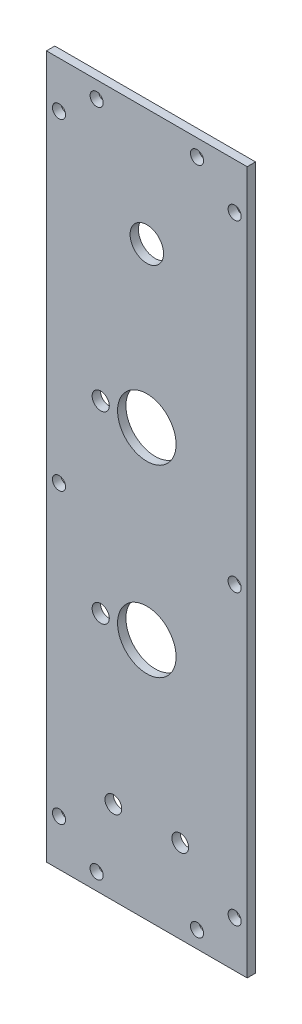
ISO-10303-21;
HEADER;
FILE_DESCRIPTION(('STEP AP214'),'2;1');
FILE_NAME('part.step','',(''),(''),'','','');
FILE_SCHEMA(('AUTOMOTIVE_DESIGN { 1 0 10303 214 1 1 1 1 }'));
ENDSEC;
DATA;
#1=APPLICATION_CONTEXT('core data for automotive mechanical design processes');
#2=APPLICATION_PROTOCOL_DEFINITION('international standard','automotive_design',2000,#1);
#3=PRODUCT_CONTEXT('',#1,'mechanical');
#4=PRODUCT('Part','Part','',(#3));
#5=PRODUCT_RELATED_PRODUCT_CATEGORY('part','',(#4));
#6=PRODUCT_DEFINITION_FORMATION('','',#4);
#7=PRODUCT_DEFINITION_CONTEXT('part definition',#1,'design');
#8=PRODUCT_DEFINITION('design','',#6,#7);
#9=PRODUCT_DEFINITION_SHAPE('','',#8);
#10=(LENGTH_UNIT() NAMED_UNIT(*) SI_UNIT(.MILLI.,.METRE.));
#11=(NAMED_UNIT(*) PLANE_ANGLE_UNIT() SI_UNIT($,.RADIAN.));
#12=(NAMED_UNIT(*) SI_UNIT($,.STERADIAN.) SOLID_ANGLE_UNIT());
#13=UNCERTAINTY_MEASURE_WITH_UNIT(LENGTH_MEASURE(1.E-05),#10,'distance_accuracy_value','');
#14=(GEOMETRIC_REPRESENTATION_CONTEXT(3) GLOBAL_UNCERTAINTY_ASSIGNED_CONTEXT((#13)) GLOBAL_UNIT_ASSIGNED_CONTEXT((#10,
#11,#12)) REPRESENTATION_CONTEXT('',''));
#15=CARTESIAN_POINT('',(0.,0.,0.));
#16=DIRECTION('',(0.,0.,1.));
#17=DIRECTION('',(1.,0.,0.));
#18=AXIS2_PLACEMENT_3D('',#15,#16,#17);
#19=CARTESIAN_POINT('',(0.,0.,3.175));
#20=DIRECTION('',(0.,0.,1.));
#21=DIRECTION('',(1.,0.,0.));
#22=AXIS2_PLACEMENT_3D('',#19,#20,#21);
#23=PLANE('',#22);
#24=CARTESIAN_POINT('',(50.8,-234.95,3.175));
#25=DIRECTION('',(0.,0.,1.));
#26=DIRECTION('',(1.,0.,0.));
#27=AXIS2_PLACEMENT_3D('',#24,#25,#26);
#28=CIRCLE('',#27,3.175);
#29=CARTESIAN_POINT('',(53.975,-234.95,3.175));
#30=VERTEX_POINT('',#29);
#31=EDGE_CURVE('E233',#30,#30,#28,.T.);
#32=ORIENTED_EDGE('',*,*,#31,.F.);
#33=EDGE_LOOP('',(#32));
#34=FACE_BOUND('',#33,.T.);
#35=CARTESIAN_POINT('',(20.599908,-174.625,3.175));
#36=DIRECTION('',(0.,0.,1.));
#37=DIRECTION('',(1.,0.,0.));
#38=AXIS2_PLACEMENT_3D('',#35,#36,#37);
#39=CIRCLE('',#38,3.2512);
#40=CARTESIAN_POINT('',(23.851108,-174.625,3.175));
#41=VERTEX_POINT('',#40);
#42=EDGE_CURVE('E242',#41,#41,#39,.T.);
#43=ORIENTED_EDGE('',*,*,#42,.F.);
#44=EDGE_LOOP('',(#43));
#45=FACE_BOUND('',#44,.T.);
#46=CARTESIAN_POINT('',(38.1,-174.625,3.175));
#47=DIRECTION('',(0.,0.,1.));
#48=DIRECTION('',(1.,0.,0.));
#49=AXIS2_PLACEMENT_3D('',#46,#47,#48);
#50=CIRCLE('',#49,11.1125);
#51=CARTESIAN_POINT('',(49.2125,-174.625,3.175));
#52=VERTEX_POINT('',#51);
#53=EDGE_CURVE('E217',#52,#52,#50,.T.);
#54=ORIENTED_EDGE('',*,*,#53,.F.);
#55=EDGE_LOOP('',(#54));
#56=FACE_BOUND('',#55,.T.);
#57=CARTESIAN_POINT('',(20.599908,-104.775,3.175));
#58=DIRECTION('',(0.,0.,1.));
#59=DIRECTION('',(1.,0.,0.));
#60=AXIS2_PLACEMENT_3D('',#57,#58,#59);
#61=CIRCLE('',#60,3.2512);
#62=CARTESIAN_POINT('',(23.851108,-104.775,3.175));
#63=VERTEX_POINT('',#62);
#64=EDGE_CURVE('E226',#63,#63,#61,.T.);
#65=ORIENTED_EDGE('',*,*,#64,.F.);
#66=EDGE_LOOP('',(#65));
#67=FACE_BOUND('',#66,.T.);
#68=CARTESIAN_POINT('',(25.4,-234.95,3.175));
#69=DIRECTION('',(0.,0.,1.));
#70=DIRECTION('',(1.,0.,0.));
#71=AXIS2_PLACEMENT_3D('',#68,#69,#70);
#72=CIRCLE('',#71,3.175);
#73=CARTESIAN_POINT('',(28.575,-234.95,3.175));
#74=VERTEX_POINT('',#73);
#75=EDGE_CURVE('E257',#74,#74,#72,.T.);
#76=ORIENTED_EDGE('',*,*,#75,.F.);
#77=EDGE_LOOP('',(#76));
#78=FACE_BOUND('',#77,.T.);
#79=CARTESIAN_POINT('',(38.1,-44.45,3.175));
#80=DIRECTION('',(0.,0.,1.));
#81=DIRECTION('',(1.,0.,0.));
#82=AXIS2_PLACEMENT_3D('',#79,#80,#81);
#83=CIRCLE('',#82,6.35);
#84=CARTESIAN_POINT('',(44.45,-44.45,3.175));
#85=VERTEX_POINT('',#84);
#86=EDGE_CURVE('E249',#85,#85,#83,.T.);
#87=ORIENTED_EDGE('',*,*,#86,.F.);
#88=EDGE_LOOP('',(#87));
#89=FACE_BOUND('',#88,.T.);
#90=CARTESIAN_POINT('',(38.1,-104.775,3.175));
#91=DIRECTION('',(0.,0.,1.));
#92=DIRECTION('',(1.,0.,0.));
#93=AXIS2_PLACEMENT_3D('',#90,#91,#92);
#94=CIRCLE('',#93,11.1125);
#95=CARTESIAN_POINT('',(49.2125,-104.775,3.175));
#96=VERTEX_POINT('',#95);
#97=EDGE_CURVE('E209',#96,#96,#94,.T.);
#98=ORIENTED_EDGE('',*,*,#97,.F.);
#99=EDGE_LOOP('',(#98));
#100=FACE_BOUND('',#99,.T.);
#101=CARTESIAN_POINT('',(19.05,-260.35,3.175));
#102=DIRECTION('',(0.,0.,1.));
#103=DIRECTION('',(1.,0.,0.));
#104=AXIS2_PLACEMENT_3D('',#101,#102,#103);
#105=CIRCLE('',#104,2.4892);
#106=CARTESIAN_POINT('',(21.5392,-260.35,3.175));
#107=VERTEX_POINT('',#106);
#108=EDGE_CURVE('E189',#107,#107,#105,.T.);
#109=ORIENTED_EDGE('',*,*,#108,.F.);
#110=EDGE_LOOP('',(#109));
#111=FACE_BOUND('',#110,.T.);
#112=CARTESIAN_POINT('',(71.4375,-249.2375,3.175));
#113=DIRECTION('',(0.,0.,1.));
#114=DIRECTION('',(1.,0.,0.));
#115=AXIS2_PLACEMENT_3D('',#112,#113,#114);
#116=CIRCLE('',#115,2.48920000000001);
#117=CARTESIAN_POINT('',(73.9267,-249.2375,3.175));
#118=VERTEX_POINT('',#117);
#119=EDGE_CURVE('E173',#118,#118,#116,.T.);
#120=ORIENTED_EDGE('',*,*,#119,.F.);
#121=EDGE_LOOP('',(#120));
#122=FACE_BOUND('',#121,.T.);
#123=CARTESIAN_POINT('',(71.4375,-139.7,3.175));
#124=DIRECTION('',(0.,0.,1.));
#125=DIRECTION('',(1.,0.,0.));
#126=AXIS2_PLACEMENT_3D('',#123,#124,#125);
#127=CIRCLE('',#126,2.48920000000001);
#128=CARTESIAN_POINT('',(73.9267,-139.7,3.175));
#129=VERTEX_POINT('',#128);
#130=EDGE_CURVE('E157',#129,#129,#127,.T.);
#131=ORIENTED_EDGE('',*,*,#130,.F.);
#132=EDGE_LOOP('',(#131));
#133=FACE_BOUND('',#132,.T.);
#134=CARTESIAN_POINT('',(71.4375,-17.4625,3.175));
#135=DIRECTION('',(0.,0.,1.));
#136=DIRECTION('',(1.,0.,0.));
#137=AXIS2_PLACEMENT_3D('',#134,#135,#136);
#138=CIRCLE('',#137,2.4892);
#139=CARTESIAN_POINT('',(73.9267,-17.4625,3.175));
#140=VERTEX_POINT('',#139);
#141=EDGE_CURVE('E141',#140,#140,#138,.T.);
#142=ORIENTED_EDGE('',*,*,#141,.F.);
#143=EDGE_LOOP('',(#142));
#144=FACE_BOUND('',#143,.T.);
#145=CARTESIAN_POINT('',(19.05,-6.35,3.175));
#146=DIRECTION('',(0.,0.,1.));
#147=DIRECTION('',(1.,0.,0.));
#148=AXIS2_PLACEMENT_3D('',#145,#146,#147);
#149=CIRCLE('',#148,2.4892);
#150=CARTESIAN_POINT('',(21.5392,-6.35,3.175));
#151=VERTEX_POINT('',#150);
#152=EDGE_CURVE('E111',#151,#151,#149,.T.);
#153=ORIENTED_EDGE('',*,*,#152,.F.);
#154=EDGE_LOOP('',(#153));
#155=FACE_BOUND('',#154,.T.);
#156=DIRECTION('',(0.,-1.,0.));
#157=VECTOR('',#156,1.);
#158=CARTESIAN_POINT('',(0.,0.,3.175));
#159=LINE('',#158,#157);
#160=CARTESIAN_POINT('',(0.,0.,3.175));
#161=VERTEX_POINT('',#160);
#162=CARTESIAN_POINT('',(0.,-266.7,3.175));
#163=VERTEX_POINT('',#162);
#164=EDGE_CURVE('E91',#161,#163,#159,.T.);
#165=ORIENTED_EDGE('',*,*,#164,.T.);
#166=DIRECTION('',(1.,0.,0.));
#167=VECTOR('',#166,1.);
#168=CARTESIAN_POINT('',(0.,-266.7,3.175));
#169=LINE('',#168,#167);
#170=CARTESIAN_POINT('',(76.2,-266.7,3.175));
#171=VERTEX_POINT('',#170);
#172=EDGE_CURVE('E86',#163,#171,#169,.T.);
#173=ORIENTED_EDGE('',*,*,#172,.T.);
#174=DIRECTION('',(0.,1.,0.));
#175=VECTOR('',#174,1.);
#176=CARTESIAN_POINT('',(76.2,0.,3.175));
#177=LINE('',#176,#175);
#178=CARTESIAN_POINT('',(76.2,0.,3.175));
#179=VERTEX_POINT('',#178);
#180=EDGE_CURVE('E89',#171,#179,#177,.T.);
#181=ORIENTED_EDGE('',*,*,#180,.T.);
#182=DIRECTION('',(-1.,0.,0.));
#183=VECTOR('',#182,1.);
#184=CARTESIAN_POINT('',(0.,0.,3.175));
#185=LINE('',#184,#183);
#186=EDGE_CURVE('E56',#179,#161,#185,.T.);
#187=ORIENTED_EDGE('',*,*,#186,.T.);
#188=EDGE_LOOP('',(#165,#173,#181,#187));
#189=FACE_BOUND('',#188,.T.);
#190=CARTESIAN_POINT('',(57.15,-6.35,3.175));
#191=DIRECTION('',(0.,0.,1.));
#192=DIRECTION('',(1.,0.,0.));
#193=AXIS2_PLACEMENT_3D('',#190,#191,#192);
#194=CIRCLE('',#193,2.4892);
#195=CARTESIAN_POINT('',(59.6392,-6.35,3.175));
#196=VERTEX_POINT('',#195);
#197=EDGE_CURVE('E133',#196,#196,#194,.T.);
#198=ORIENTED_EDGE('',*,*,#197,.F.);
#199=EDGE_LOOP('',(#198));
#200=FACE_BOUND('',#199,.T.);
#201=CARTESIAN_POINT('',(4.7625,-17.4625,3.175));
#202=DIRECTION('',(0.,0.,1.));
#203=DIRECTION('',(1.,0.,0.));
#204=AXIS2_PLACEMENT_3D('',#201,#202,#203);
#205=CIRCLE('',#204,2.4892);
#206=CARTESIAN_POINT('',(7.2517,-17.4625,3.175));
#207=VERTEX_POINT('',#206);
#208=EDGE_CURVE('E149',#207,#207,#205,.T.);
#209=ORIENTED_EDGE('',*,*,#208,.F.);
#210=EDGE_LOOP('',(#209));
#211=FACE_BOUND('',#210,.T.);
#212=CARTESIAN_POINT('',(4.76250000000002,-139.7,3.175));
#213=DIRECTION('',(0.,0.,1.));
#214=DIRECTION('',(1.,0.,0.));
#215=AXIS2_PLACEMENT_3D('',#212,#213,#214);
#216=CIRCLE('',#215,2.4892);
#217=CARTESIAN_POINT('',(7.25170000000002,-139.7,3.175));
#218=VERTEX_POINT('',#217);
#219=EDGE_CURVE('E165',#218,#218,#216,.T.);
#220=ORIENTED_EDGE('',*,*,#219,.F.);
#221=EDGE_LOOP('',(#220));
#222=FACE_BOUND('',#221,.T.);
#223=CARTESIAN_POINT('',(4.76250000000003,-249.2375,3.175));
#224=DIRECTION('',(0.,0.,1.));
#225=DIRECTION('',(1.,0.,0.));
#226=AXIS2_PLACEMENT_3D('',#223,#224,#225);
#227=CIRCLE('',#226,2.4892);
#228=CARTESIAN_POINT('',(7.25170000000003,-249.2375,3.175));
#229=VERTEX_POINT('',#228);
#230=EDGE_CURVE('E181',#229,#229,#227,.T.);
#231=ORIENTED_EDGE('',*,*,#230,.F.);
#232=EDGE_LOOP('',(#231));
#233=FACE_BOUND('',#232,.T.);
#234=CARTESIAN_POINT('',(57.15,-260.35,3.175));
#235=DIRECTION('',(0.,0.,1.));
#236=DIRECTION('',(1.,0.,0.));
#237=AXIS2_PLACEMENT_3D('',#234,#235,#236);
#238=CIRCLE('',#237,2.4892);
#239=CARTESIAN_POINT('',(59.6392,-260.35,3.175));
#240=VERTEX_POINT('',#239);
#241=EDGE_CURVE('E197',#240,#240,#238,.T.);
#242=ORIENTED_EDGE('',*,*,#241,.F.);
#243=EDGE_LOOP('',(#242));
#244=FACE_BOUND('',#243,.T.);
#245=ADVANCED_FACE('F38',(#34,#45,#56,#67,#78,#89,#100,#111,#122,#133,#144,#155,#189,#200,#211,
#222,#233,#244),#23,.T.);
#246=CARTESIAN_POINT('',(0.,0.,0.));
#247=DIRECTION('',(0.,0.,1.));
#248=DIRECTION('',(1.,0.,0.));
#249=AXIS2_PLACEMENT_3D('',#246,#247,#248);
#250=PLANE('',#249);
#251=CARTESIAN_POINT('',(50.8,-234.95,0.));
#252=DIRECTION('',(0.,0.,1.));
#253=DIRECTION('',(1.,0.,0.));
#254=AXIS2_PLACEMENT_3D('',#251,#252,#253);
#255=CIRCLE('',#254,3.175);
#256=CARTESIAN_POINT('',(53.975,-234.95,0.));
#257=VERTEX_POINT('',#256);
#258=EDGE_CURVE('E237',#257,#257,#255,.T.);
#259=ORIENTED_EDGE('',*,*,#258,.T.);
#260=EDGE_LOOP('',(#259));
#261=FACE_BOUND('',#260,.T.);
#262=CARTESIAN_POINT('',(20.599908,-174.625,0.));
#263=DIRECTION('',(0.,0.,1.));
#264=DIRECTION('',(1.,0.,0.));
#265=AXIS2_PLACEMENT_3D('',#262,#263,#264);
#266=CIRCLE('',#265,3.2512);
#267=CARTESIAN_POINT('',(23.851108,-174.625,0.));
#268=VERTEX_POINT('',#267);
#269=EDGE_CURVE('E222',#268,#268,#266,.T.);
#270=ORIENTED_EDGE('',*,*,#269,.T.);
#271=EDGE_LOOP('',(#270));
#272=FACE_BOUND('',#271,.T.);
#273=CARTESIAN_POINT('',(38.1,-174.625,0.));
#274=DIRECTION('',(0.,0.,1.));
#275=DIRECTION('',(1.,0.,0.));
#276=AXIS2_PLACEMENT_3D('',#273,#274,#275);
#277=CIRCLE('',#276,11.1125);
#278=CARTESIAN_POINT('',(49.2125,-174.625,0.));
#279=VERTEX_POINT('',#278);
#280=EDGE_CURVE('E221',#279,#279,#277,.T.);
#281=ORIENTED_EDGE('',*,*,#280,.T.);
#282=EDGE_LOOP('',(#281));
#283=FACE_BOUND('',#282,.T.);
#284=CARTESIAN_POINT('',(20.599908,-104.775,0.));
#285=DIRECTION('',(0.,0.,1.));
#286=DIRECTION('',(1.,0.,0.));
#287=AXIS2_PLACEMENT_3D('',#284,#285,#286);
#288=CIRCLE('',#287,3.2512);
#289=CARTESIAN_POINT('',(23.851108,-104.775,0.));
#290=VERTEX_POINT('',#289);
#291=EDGE_CURVE('E213',#290,#290,#288,.T.);
#292=ORIENTED_EDGE('',*,*,#291,.T.);
#293=EDGE_LOOP('',(#292));
#294=FACE_BOUND('',#293,.T.);
#295=CARTESIAN_POINT('',(25.4,-234.95,0.));
#296=DIRECTION('',(0.,0.,1.));
#297=DIRECTION('',(1.,0.,0.));
#298=AXIS2_PLACEMENT_3D('',#295,#296,#297);
#299=CIRCLE('',#298,3.175);
#300=CARTESIAN_POINT('',(28.575,-234.95,0.));
#301=VERTEX_POINT('',#300);
#302=EDGE_CURVE('E238',#301,#301,#299,.T.);
#303=ORIENTED_EDGE('',*,*,#302,.T.);
#304=EDGE_LOOP('',(#303));
#305=FACE_BOUND('',#304,.T.);
#306=CARTESIAN_POINT('',(38.1,-44.45,0.));
#307=DIRECTION('',(0.,0.,1.));
#308=DIRECTION('',(1.,0.,0.));
#309=AXIS2_PLACEMENT_3D('',#306,#307,#308);
#310=CIRCLE('',#309,6.35);
#311=CARTESIAN_POINT('',(44.45,-44.45,0.));
#312=VERTEX_POINT('',#311);
#313=EDGE_CURVE('E253',#312,#312,#310,.T.);
#314=ORIENTED_EDGE('',*,*,#313,.T.);
#315=EDGE_LOOP('',(#314));
#316=FACE_BOUND('',#315,.T.);
#317=CARTESIAN_POINT('',(38.1,-104.775,0.));
#318=DIRECTION('',(0.,0.,1.));
#319=DIRECTION('',(1.,0.,0.));
#320=AXIS2_PLACEMENT_3D('',#317,#318,#319);
#321=CIRCLE('',#320,11.1125);
#322=CARTESIAN_POINT('',(49.2125,-104.775,0.));
#323=VERTEX_POINT('',#322);
#324=EDGE_CURVE('E205',#323,#323,#321,.T.);
#325=ORIENTED_EDGE('',*,*,#324,.T.);
#326=EDGE_LOOP('',(#325));
#327=FACE_BOUND('',#326,.T.);
#328=DIRECTION('',(0.,-1.,0.));
#329=VECTOR('',#328,1.);
#330=CARTESIAN_POINT('',(0.,0.,0.));
#331=LINE('',#330,#329);
#332=CARTESIAN_POINT('',(0.,0.,0.));
#333=VERTEX_POINT('',#332);
#334=CARTESIAN_POINT('',(0.,-266.7,0.));
#335=VERTEX_POINT('',#334);
#336=EDGE_CURVE('E107',#333,#335,#331,.T.);
#337=ORIENTED_EDGE('',*,*,#336,.F.);
#338=DIRECTION('',(-1.,0.,0.));
#339=VECTOR('',#338,1.);
#340=CARTESIAN_POINT('',(0.,0.,0.));
#341=LINE('',#340,#339);
#342=CARTESIAN_POINT('',(76.2,0.,0.));
#343=VERTEX_POINT('',#342);
#344=EDGE_CURVE('E79',#343,#333,#341,.T.);
#345=ORIENTED_EDGE('',*,*,#344,.F.);
#346=DIRECTION('',(0.,1.,0.));
#347=VECTOR('',#346,1.);
#348=CARTESIAN_POINT('',(76.2,0.,0.));
#349=LINE('',#348,#347);
#350=CARTESIAN_POINT('',(76.2,-266.7,0.));
#351=VERTEX_POINT('',#350);
#352=EDGE_CURVE('E73',#351,#343,#349,.T.);
#353=ORIENTED_EDGE('',*,*,#352,.F.);
#354=DIRECTION('',(1.,0.,0.));
#355=VECTOR('',#354,1.);
#356=CARTESIAN_POINT('',(0.,-266.7,0.));
#357=LINE('',#356,#355);
#358=EDGE_CURVE('E96',#335,#351,#357,.T.);
#359=ORIENTED_EDGE('',*,*,#358,.F.);
#360=EDGE_LOOP('',(#337,#345,#353,#359));
#361=FACE_BOUND('',#360,.T.);
#362=CARTESIAN_POINT('',(19.05,-6.35,0.));
#363=DIRECTION('',(0.,0.,1.));
#364=DIRECTION('',(1.,0.,0.));
#365=AXIS2_PLACEMENT_3D('',#362,#363,#364);
#366=CIRCLE('',#365,2.4892);
#367=CARTESIAN_POINT('',(21.5392,-6.35,0.));
#368=VERTEX_POINT('',#367);
#369=EDGE_CURVE('E129',#368,#368,#366,.T.);
#370=ORIENTED_EDGE('',*,*,#369,.T.);
#371=EDGE_LOOP('',(#370));
#372=FACE_BOUND('',#371,.T.);
#373=CARTESIAN_POINT('',(57.15,-6.35,0.));
#374=DIRECTION('',(0.,0.,1.));
#375=DIRECTION('',(1.,0.,0.));
#376=AXIS2_PLACEMENT_3D('',#373,#374,#375);
#377=CIRCLE('',#376,2.4892);
#378=CARTESIAN_POINT('',(59.6392,-6.35,0.));
#379=VERTEX_POINT('',#378);
#380=EDGE_CURVE('E137',#379,#379,#377,.T.);
#381=ORIENTED_EDGE('',*,*,#380,.T.);
#382=EDGE_LOOP('',(#381));
#383=FACE_BOUND('',#382,.T.);
#384=CARTESIAN_POINT('',(71.4375,-17.4625,0.));
#385=DIRECTION('',(0.,0.,1.));
#386=DIRECTION('',(1.,0.,0.));
#387=AXIS2_PLACEMENT_3D('',#384,#385,#386);
#388=CIRCLE('',#387,2.4892);
#389=CARTESIAN_POINT('',(73.9267,-17.4625,0.));
#390=VERTEX_POINT('',#389);
#391=EDGE_CURVE('E145',#390,#390,#388,.T.);
#392=ORIENTED_EDGE('',*,*,#391,.T.);
#393=EDGE_LOOP('',(#392));
#394=FACE_BOUND('',#393,.T.);
#395=CARTESIAN_POINT('',(4.7625,-17.4625,0.));
#396=DIRECTION('',(0.,0.,1.));
#397=DIRECTION('',(1.,0.,0.));
#398=AXIS2_PLACEMENT_3D('',#395,#396,#397);
#399=CIRCLE('',#398,2.4892);
#400=CARTESIAN_POINT('',(7.2517,-17.4625,0.));
#401=VERTEX_POINT('',#400);
#402=EDGE_CURVE('E153',#401,#401,#399,.T.);
#403=ORIENTED_EDGE('',*,*,#402,.T.);
#404=EDGE_LOOP('',(#403));
#405=FACE_BOUND('',#404,.T.);
#406=CARTESIAN_POINT('',(71.4375,-139.7,0.));
#407=DIRECTION('',(0.,0.,1.));
#408=DIRECTION('',(1.,0.,0.));
#409=AXIS2_PLACEMENT_3D('',#406,#407,#408);
#410=CIRCLE('',#409,2.48920000000001);
#411=CARTESIAN_POINT('',(73.9267,-139.7,0.));
#412=VERTEX_POINT('',#411);
#413=EDGE_CURVE('E161',#412,#412,#410,.T.);
#414=ORIENTED_EDGE('',*,*,#413,.T.);
#415=EDGE_LOOP('',(#414));
#416=FACE_BOUND('',#415,.T.);
#417=CARTESIAN_POINT('',(4.76250000000002,-139.7,0.));
#418=DIRECTION('',(0.,0.,1.));
#419=DIRECTION('',(1.,0.,0.));
#420=AXIS2_PLACEMENT_3D('',#417,#418,#419);
#421=CIRCLE('',#420,2.4892);
#422=CARTESIAN_POINT('',(7.25170000000002,-139.7,0.));
#423=VERTEX_POINT('',#422);
#424=EDGE_CURVE('E169',#423,#423,#421,.T.);
#425=ORIENTED_EDGE('',*,*,#424,.T.);
#426=EDGE_LOOP('',(#425));
#427=FACE_BOUND('',#426,.T.);
#428=CARTESIAN_POINT('',(71.4375,-249.2375,0.));
#429=DIRECTION('',(0.,0.,1.));
#430=DIRECTION('',(1.,0.,0.));
#431=AXIS2_PLACEMENT_3D('',#428,#429,#430);
#432=CIRCLE('',#431,2.48920000000001);
#433=CARTESIAN_POINT('',(73.9267,-249.2375,0.));
#434=VERTEX_POINT('',#433);
#435=EDGE_CURVE('E177',#434,#434,#432,.T.);
#436=ORIENTED_EDGE('',*,*,#435,.T.);
#437=EDGE_LOOP('',(#436));
#438=FACE_BOUND('',#437,.T.);
#439=CARTESIAN_POINT('',(4.76250000000003,-249.2375,0.));
#440=DIRECTION('',(0.,0.,1.));
#441=DIRECTION('',(1.,0.,0.));
#442=AXIS2_PLACEMENT_3D('',#439,#440,#441);
#443=CIRCLE('',#442,2.4892);
#444=CARTESIAN_POINT('',(7.25170000000003,-249.2375,0.));
#445=VERTEX_POINT('',#444);
#446=EDGE_CURVE('E185',#445,#445,#443,.T.);
#447=ORIENTED_EDGE('',*,*,#446,.T.);
#448=EDGE_LOOP('',(#447));
#449=FACE_BOUND('',#448,.T.);
#450=CARTESIAN_POINT('',(19.05,-260.35,0.));
#451=DIRECTION('',(0.,0.,1.));
#452=DIRECTION('',(1.,0.,0.));
#453=AXIS2_PLACEMENT_3D('',#450,#451,#452);
#454=CIRCLE('',#453,2.4892);
#455=CARTESIAN_POINT('',(21.5392,-260.35,0.));
#456=VERTEX_POINT('',#455);
#457=EDGE_CURVE('E193',#456,#456,#454,.T.);
#458=ORIENTED_EDGE('',*,*,#457,.T.);
#459=EDGE_LOOP('',(#458));
#460=FACE_BOUND('',#459,.T.);
#461=CARTESIAN_POINT('',(57.15,-260.35,0.));
#462=DIRECTION('',(0.,0.,1.));
#463=DIRECTION('',(1.,0.,0.));
#464=AXIS2_PLACEMENT_3D('',#461,#462,#463);
#465=CIRCLE('',#464,2.4892);
#466=CARTESIAN_POINT('',(59.6392,-260.35,0.));
#467=VERTEX_POINT('',#466);
#468=EDGE_CURVE('E201',#467,#467,#465,.T.);
#469=ORIENTED_EDGE('',*,*,#468,.T.);
#470=EDGE_LOOP('',(#469));
#471=FACE_BOUND('',#470,.T.);
#472=ADVANCED_FACE('F124',(#261,#272,#283,#294,#305,#316,#327,#361,#372,#383,#394,#405,#416,
#427,#438,#449,#460,#471),#250,.F.);
#473=CARTESIAN_POINT('',(0.,0.,3.175));
#474=DIRECTION('',(1.,0.,0.));
#475=DIRECTION('',(0.,1.,0.));
#476=AXIS2_PLACEMENT_3D('',#473,#474,#475);
#477=PLANE('',#476);
#478=ORIENTED_EDGE('',*,*,#336,.T.);
#479=DIRECTION('',(0.,0.,-1.));
#480=VECTOR('',#479,1.);
#481=CARTESIAN_POINT('',(0.,-266.7,3.175));
#482=LINE('',#481,#480);
#483=EDGE_CURVE('E11',#163,#335,#482,.T.);
#484=ORIENTED_EDGE('',*,*,#483,.F.);
#485=ORIENTED_EDGE('',*,*,#164,.F.);
#486=DIRECTION('',(0.,0.,-1.));
#487=VECTOR('',#486,1.);
#488=CARTESIAN_POINT('',(0.,0.,3.175));
#489=LINE('',#488,#487);
#490=EDGE_CURVE('E103',#161,#333,#489,.T.);
#491=ORIENTED_EDGE('',*,*,#490,.T.);
#492=EDGE_LOOP('',(#478,#484,#485,#491));
#493=FACE_BOUND('',#492,.T.);
#494=ADVANCED_FACE('F40',(#493),#477,.F.);
#495=CARTESIAN_POINT('',(0.,-266.7,3.175));
#496=DIRECTION('',(0.,1.,0.));
#497=DIRECTION('',(0.,0.,1.));
#498=AXIS2_PLACEMENT_3D('',#495,#496,#497);
#499=PLANE('',#498);
#500=ORIENTED_EDGE('',*,*,#358,.T.);
#501=DIRECTION('',(0.,0.,-1.));
#502=VECTOR('',#501,1.);
#503=CARTESIAN_POINT('',(76.2,-266.7,3.175));
#504=LINE('',#503,#502);
#505=EDGE_CURVE('E48',#171,#351,#504,.T.);
#506=ORIENTED_EDGE('',*,*,#505,.F.);
#507=ORIENTED_EDGE('',*,*,#172,.F.);
#508=ORIENTED_EDGE('',*,*,#483,.T.);
#509=EDGE_LOOP('',(#500,#506,#507,#508));
#510=FACE_BOUND('',#509,.T.);
#511=ADVANCED_FACE('F95',(#510),#499,.F.);
#512=CARTESIAN_POINT('',(76.2,0.,3.175));
#513=DIRECTION('',(-1.,0.,0.));
#514=DIRECTION('',(0.,-1.,0.));
#515=AXIS2_PLACEMENT_3D('',#512,#513,#514);
#516=PLANE('',#515);
#517=ORIENTED_EDGE('',*,*,#352,.T.);
#518=DIRECTION('',(0.,0.,-1.));
#519=VECTOR('',#518,1.);
#520=CARTESIAN_POINT('',(76.2,0.,3.175));
#521=LINE('',#520,#519);
#522=EDGE_CURVE('E98',#179,#343,#521,.T.);
#523=ORIENTED_EDGE('',*,*,#522,.F.);
#524=ORIENTED_EDGE('',*,*,#180,.F.);
#525=ORIENTED_EDGE('',*,*,#505,.T.);
#526=EDGE_LOOP('',(#517,#523,#524,#525));
#527=FACE_BOUND('',#526,.T.);
#528=ADVANCED_FACE('F99',(#527),#516,.F.);
#529=CARTESIAN_POINT('',(0.,0.,3.175));
#530=DIRECTION('',(0.,-1.,0.));
#531=DIRECTION('',(0.,0.,-1.));
#532=AXIS2_PLACEMENT_3D('',#529,#530,#531);
#533=PLANE('',#532);
#534=ORIENTED_EDGE('',*,*,#344,.T.);
#535=ORIENTED_EDGE('',*,*,#490,.F.);
#536=ORIENTED_EDGE('',*,*,#186,.F.);
#537=ORIENTED_EDGE('',*,*,#522,.T.);
#538=EDGE_LOOP('',(#534,#535,#536,#537));
#539=FACE_BOUND('',#538,.T.);
#540=ADVANCED_FACE('F121',(#539),#533,.F.);
#541=CARTESIAN_POINT('',(19.05,-6.35,3.175));
#542=DIRECTION('',(0.,0.,-1.));
#543=DIRECTION('',(-1.,0.,0.));
#544=AXIS2_PLACEMENT_3D('',#541,#542,#543);
#545=CYLINDRICAL_SURFACE('',#544,2.4892);
#546=ORIENTED_EDGE('',*,*,#152,.T.);
#547=EDGE_LOOP('',(#546));
#548=FACE_BOUND('',#547,.T.);
#549=ORIENTED_EDGE('',*,*,#369,.F.);
#550=EDGE_LOOP('',(#549));
#551=FACE_BOUND('',#550,.T.);
#552=ADVANCED_FACE('F293',(#548,#551),#545,.F.);
#553=CARTESIAN_POINT('',(57.15,-6.35,3.175));
#554=DIRECTION('',(0.,0.,-1.));
#555=DIRECTION('',(-1.,0.,0.));
#556=AXIS2_PLACEMENT_3D('',#553,#554,#555);
#557=CYLINDRICAL_SURFACE('',#556,2.4892);
#558=ORIENTED_EDGE('',*,*,#197,.T.);
#559=EDGE_LOOP('',(#558));
#560=FACE_BOUND('',#559,.T.);
#561=ORIENTED_EDGE('',*,*,#380,.F.);
#562=EDGE_LOOP('',(#561));
#563=FACE_BOUND('',#562,.T.);
#564=ADVANCED_FACE('F296',(#560,#563),#557,.F.);
#565=CARTESIAN_POINT('',(71.4375,-17.4625,3.175));
#566=DIRECTION('',(0.,0.,-1.));
#567=DIRECTION('',(-1.,0.,0.));
#568=AXIS2_PLACEMENT_3D('',#565,#566,#567);
#569=CYLINDRICAL_SURFACE('',#568,2.4892);
#570=ORIENTED_EDGE('',*,*,#141,.T.);
#571=EDGE_LOOP('',(#570));
#572=FACE_BOUND('',#571,.T.);
#573=ORIENTED_EDGE('',*,*,#391,.F.);
#574=EDGE_LOOP('',(#573));
#575=FACE_BOUND('',#574,.T.);
#576=ADVANCED_FACE('F356',(#572,#575),#569,.F.);
#577=CARTESIAN_POINT('',(4.7625,-17.4625,3.175));
#578=DIRECTION('',(0.,0.,-1.));
#579=DIRECTION('',(-1.,0.,0.));
#580=AXIS2_PLACEMENT_3D('',#577,#578,#579);
#581=CYLINDRICAL_SURFACE('',#580,2.4892);
#582=ORIENTED_EDGE('',*,*,#208,.T.);
#583=EDGE_LOOP('',(#582));
#584=FACE_BOUND('',#583,.T.);
#585=ORIENTED_EDGE('',*,*,#402,.F.);
#586=EDGE_LOOP('',(#585));
#587=FACE_BOUND('',#586,.T.);
#588=ADVANCED_FACE('F352',(#584,#587),#581,.F.);
#589=CARTESIAN_POINT('',(71.4375,-139.7,3.175));
#590=DIRECTION('',(0.,0.,-1.));
#591=DIRECTION('',(-1.,0.,0.));
#592=AXIS2_PLACEMENT_3D('',#589,#590,#591);
#593=CYLINDRICAL_SURFACE('',#592,2.48920000000001);
#594=ORIENTED_EDGE('',*,*,#130,.T.);
#595=EDGE_LOOP('',(#594));
#596=FACE_BOUND('',#595,.T.);
#597=ORIENTED_EDGE('',*,*,#413,.F.);
#598=EDGE_LOOP('',(#597));
#599=FACE_BOUND('',#598,.T.);
#600=ADVANCED_FACE('F348',(#596,#599),#593,.F.);
#601=CARTESIAN_POINT('',(4.76250000000002,-139.7,3.175));
#602=DIRECTION('',(0.,0.,-1.));
#603=DIRECTION('',(-1.,0.,0.));
#604=AXIS2_PLACEMENT_3D('',#601,#602,#603);
#605=CYLINDRICAL_SURFACE('',#604,2.4892);
#606=ORIENTED_EDGE('',*,*,#219,.T.);
#607=EDGE_LOOP('',(#606));
#608=FACE_BOUND('',#607,.T.);
#609=ORIENTED_EDGE('',*,*,#424,.F.);
#610=EDGE_LOOP('',(#609));
#611=FACE_BOUND('',#610,.T.);
#612=ADVANCED_FACE('F344',(#608,#611),#605,.F.);
#613=CARTESIAN_POINT('',(71.4375,-249.2375,3.175));
#614=DIRECTION('',(0.,0.,-1.));
#615=DIRECTION('',(-1.,0.,0.));
#616=AXIS2_PLACEMENT_3D('',#613,#614,#615);
#617=CYLINDRICAL_SURFACE('',#616,2.48920000000001);
#618=ORIENTED_EDGE('',*,*,#119,.T.);
#619=EDGE_LOOP('',(#618));
#620=FACE_BOUND('',#619,.T.);
#621=ORIENTED_EDGE('',*,*,#435,.F.);
#622=EDGE_LOOP('',(#621));
#623=FACE_BOUND('',#622,.T.);
#624=ADVANCED_FACE('F340',(#620,#623),#617,.F.);
#625=CARTESIAN_POINT('',(4.76250000000003,-249.2375,3.175));
#626=DIRECTION('',(0.,0.,-1.));
#627=DIRECTION('',(-1.,0.,0.));
#628=AXIS2_PLACEMENT_3D('',#625,#626,#627);
#629=CYLINDRICAL_SURFACE('',#628,2.4892);
#630=ORIENTED_EDGE('',*,*,#230,.T.);
#631=EDGE_LOOP('',(#630));
#632=FACE_BOUND('',#631,.T.);
#633=ORIENTED_EDGE('',*,*,#446,.F.);
#634=EDGE_LOOP('',(#633));
#635=FACE_BOUND('',#634,.T.);
#636=ADVANCED_FACE('F333',(#632,#635),#629,.F.);
#637=CARTESIAN_POINT('',(19.05,-260.35,3.175));
#638=DIRECTION('',(0.,0.,-1.));
#639=DIRECTION('',(-1.,0.,0.));
#640=AXIS2_PLACEMENT_3D('',#637,#638,#639);
#641=CYLINDRICAL_SURFACE('',#640,2.4892);
#642=ORIENTED_EDGE('',*,*,#108,.T.);
#643=EDGE_LOOP('',(#642));
#644=FACE_BOUND('',#643,.T.);
#645=ORIENTED_EDGE('',*,*,#457,.F.);
#646=EDGE_LOOP('',(#645));
#647=FACE_BOUND('',#646,.T.);
#648=ADVANCED_FACE('F324',(#644,#647),#641,.F.);
#649=CARTESIAN_POINT('',(57.15,-260.35,3.175));
#650=DIRECTION('',(0.,0.,-1.));
#651=DIRECTION('',(-1.,0.,0.));
#652=AXIS2_PLACEMENT_3D('',#649,#650,#651);
#653=CYLINDRICAL_SURFACE('',#652,2.4892);
#654=ORIENTED_EDGE('',*,*,#241,.T.);
#655=EDGE_LOOP('',(#654));
#656=FACE_BOUND('',#655,.T.);
#657=ORIENTED_EDGE('',*,*,#468,.F.);
#658=EDGE_LOOP('',(#657));
#659=FACE_BOUND('',#658,.T.);
#660=ADVANCED_FACE('F321',(#656,#659),#653,.F.);
#661=CARTESIAN_POINT('',(38.1,-104.775,0.));
#662=DIRECTION('',(0.,0.,1.));
#663=DIRECTION('',(1.,0.,0.));
#664=AXIS2_PLACEMENT_3D('',#661,#662,#663);
#665=CYLINDRICAL_SURFACE('',#664,11.1125);
#666=ORIENTED_EDGE('',*,*,#324,.F.);
#667=EDGE_LOOP('',(#666));
#668=FACE_BOUND('',#667,.T.);
#669=ORIENTED_EDGE('',*,*,#97,.T.);
#670=EDGE_LOOP('',(#669));
#671=FACE_BOUND('',#670,.T.);
#672=ADVANCED_FACE('F323',(#668,#671),#665,.F.);
#673=CARTESIAN_POINT('',(38.1,-44.45,0.));
#674=DIRECTION('',(0.,0.,1.));
#675=DIRECTION('',(1.,0.,0.));
#676=AXIS2_PLACEMENT_3D('',#673,#674,#675);
#677=CYLINDRICAL_SURFACE('',#676,6.35);
#678=ORIENTED_EDGE('',*,*,#313,.F.);
#679=EDGE_LOOP('',(#678));
#680=FACE_BOUND('',#679,.T.);
#681=ORIENTED_EDGE('',*,*,#86,.T.);
#682=EDGE_LOOP('',(#681));
#683=FACE_BOUND('',#682,.T.);
#684=ADVANCED_FACE('F271',(#680,#683),#677,.F.);
#685=CARTESIAN_POINT('',(25.4,-234.95,0.));
#686=DIRECTION('',(0.,0.,1.));
#687=DIRECTION('',(1.,0.,0.));
#688=AXIS2_PLACEMENT_3D('',#685,#686,#687);
#689=CYLINDRICAL_SURFACE('',#688,3.175);
#690=ORIENTED_EDGE('',*,*,#302,.F.);
#691=EDGE_LOOP('',(#690));
#692=FACE_BOUND('',#691,.T.);
#693=ORIENTED_EDGE('',*,*,#75,.T.);
#694=EDGE_LOOP('',(#693));
#695=FACE_BOUND('',#694,.T.);
#696=ADVANCED_FACE('F267',(#692,#695),#689,.F.);
#697=CARTESIAN_POINT('',(20.599908,-104.775,0.));
#698=DIRECTION('',(0.,0.,1.));
#699=DIRECTION('',(1.,0.,0.));
#700=AXIS2_PLACEMENT_3D('',#697,#698,#699);
#701=CYLINDRICAL_SURFACE('',#700,3.2512);
#702=ORIENTED_EDGE('',*,*,#291,.F.);
#703=EDGE_LOOP('',(#702));
#704=FACE_BOUND('',#703,.T.);
#705=ORIENTED_EDGE('',*,*,#64,.T.);
#706=EDGE_LOOP('',(#705));
#707=FACE_BOUND('',#706,.T.);
#708=ADVANCED_FACE('F270',(#704,#707),#701,.F.);
#709=CARTESIAN_POINT('',(38.1,-174.625,0.));
#710=DIRECTION('',(0.,0.,1.));
#711=DIRECTION('',(1.,0.,0.));
#712=AXIS2_PLACEMENT_3D('',#709,#710,#711);
#713=CYLINDRICAL_SURFACE('',#712,11.1125);
#714=ORIENTED_EDGE('',*,*,#280,.F.);
#715=EDGE_LOOP('',(#714));
#716=FACE_BOUND('',#715,.T.);
#717=ORIENTED_EDGE('',*,*,#53,.T.);
#718=EDGE_LOOP('',(#717));
#719=FACE_BOUND('',#718,.T.);
#720=ADVANCED_FACE('F487',(#716,#719),#713,.F.);
#721=CARTESIAN_POINT('',(20.599908,-174.625,0.));
#722=DIRECTION('',(0.,0.,1.));
#723=DIRECTION('',(1.,0.,0.));
#724=AXIS2_PLACEMENT_3D('',#721,#722,#723);
#725=CYLINDRICAL_SURFACE('',#724,3.2512);
#726=ORIENTED_EDGE('',*,*,#269,.F.);
#727=EDGE_LOOP('',(#726));
#728=FACE_BOUND('',#727,.T.);
#729=ORIENTED_EDGE('',*,*,#42,.T.);
#730=EDGE_LOOP('',(#729));
#731=FACE_BOUND('',#730,.T.);
#732=ADVANCED_FACE('F496',(#728,#731),#725,.F.);
#733=CARTESIAN_POINT('',(50.8,-234.95,0.));
#734=DIRECTION('',(0.,0.,1.));
#735=DIRECTION('',(1.,0.,0.));
#736=AXIS2_PLACEMENT_3D('',#733,#734,#735);
#737=CYLINDRICAL_SURFACE('',#736,3.175);
#738=ORIENTED_EDGE('',*,*,#258,.F.);
#739=EDGE_LOOP('',(#738));
#740=FACE_BOUND('',#739,.T.);
#741=ORIENTED_EDGE('',*,*,#31,.T.);
#742=EDGE_LOOP('',(#741));
#743=FACE_BOUND('',#742,.T.);
#744=ADVANCED_FACE('F504',(#740,#743),#737,.F.);
#745=CLOSED_SHELL('',(#245,#472,#494,#511,#528,#540,#552,#564,#576,#588,#600,#612,#624,#636,
#648,#660,#672,#684,#696,#708,#720,#732,#744));
#746=MANIFOLD_SOLID_BREP('B2',#745);
#747=ADVANCED_BREP_SHAPE_REPRESENTATION('',(#18,#746),#14);
#748=SHAPE_DEFINITION_REPRESENTATION(#9,#747);
ENDSEC;
END-ISO-10303-21;
